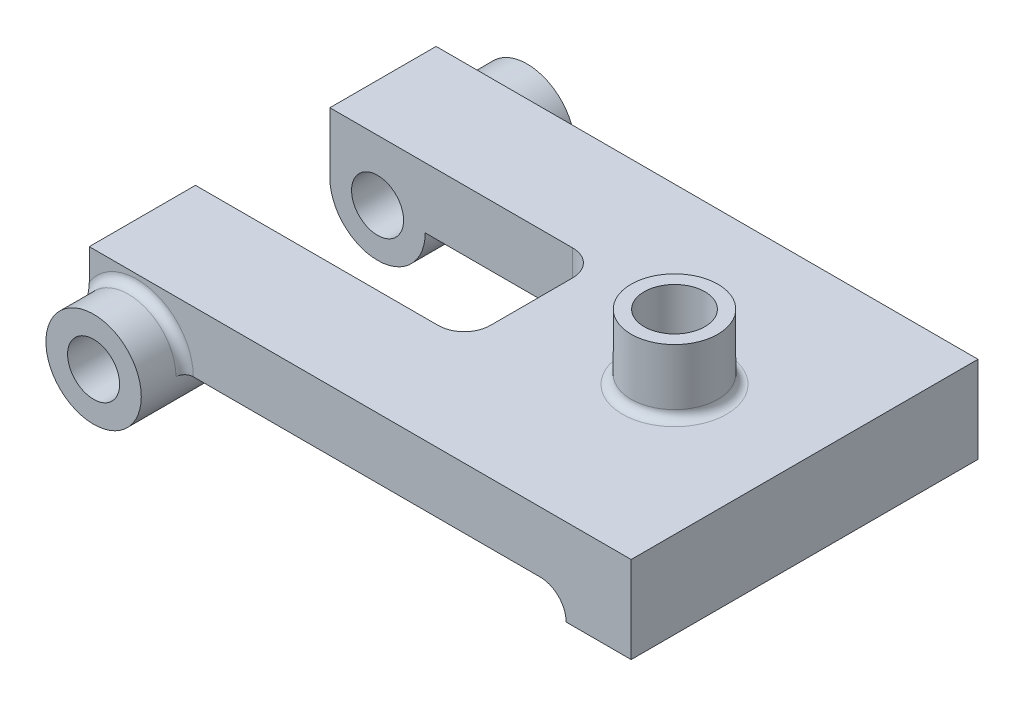
ISO-10303-21;
HEADER;
FILE_DESCRIPTION(('STEP AP214'),'2;1');
FILE_NAME('part.step','',(''),(''),'','','');
FILE_SCHEMA(('AUTOMOTIVE_DESIGN { 1 0 10303 214 1 1 1 1 }'));
ENDSEC;
DATA;
#1=APPLICATION_CONTEXT('core data for automotive mechanical design processes');
#2=APPLICATION_PROTOCOL_DEFINITION('international standard','automotive_design',2000,#1);
#3=PRODUCT_CONTEXT('',#1,'mechanical');
#4=PRODUCT('Part','Part','',(#3));
#5=PRODUCT_RELATED_PRODUCT_CATEGORY('part','',(#4));
#6=PRODUCT_DEFINITION_FORMATION('','',#4);
#7=PRODUCT_DEFINITION_CONTEXT('part definition',#1,'design');
#8=PRODUCT_DEFINITION('design','',#6,#7);
#9=PRODUCT_DEFINITION_SHAPE('','',#8);
#10=(LENGTH_UNIT() NAMED_UNIT(*) SI_UNIT(.MILLI.,.METRE.));
#11=(NAMED_UNIT(*) PLANE_ANGLE_UNIT() SI_UNIT($,.RADIAN.));
#12=(NAMED_UNIT(*) SI_UNIT($,.STERADIAN.) SOLID_ANGLE_UNIT());
#13=UNCERTAINTY_MEASURE_WITH_UNIT(LENGTH_MEASURE(1.E-05),#10,'distance_accuracy_value','');
#14=(GEOMETRIC_REPRESENTATION_CONTEXT(3) GLOBAL_UNCERTAINTY_ASSIGNED_CONTEXT((#13)) GLOBAL_UNIT_ASSIGNED_CONTEXT((#10,
#11,#12)) REPRESENTATION_CONTEXT('',''));
#15=CARTESIAN_POINT('',(0.,0.,0.));
#16=DIRECTION('',(0.,0.,1.));
#17=DIRECTION('',(1.,0.,0.));
#18=AXIS2_PLACEMENT_3D('',#15,#16,#17);
#19=CARTESIAN_POINT('',(0.,6.,-50.));
#20=DIRECTION('',(0.,-1.,0.));
#21=DIRECTION('',(1.,0.,0.));
#22=AXIS2_PLACEMENT_3D('',#19,#20,#21);
#23=PLANE('',#22);
#24=CARTESIAN_POINT('',(32.5,6.,0.00259627898913095));
#25=DIRECTION('',(0.,-1.,0.));
#26=DIRECTION('',(1.,0.,0.));
#27=AXIS2_PLACEMENT_3D('',#24,#25,#26);
#28=CIRCLE('',#27,7.99999999999998);
#29=CARTESIAN_POINT('',(40.5,6.,0.00259627898913095));
#30=VERTEX_POINT('',#29);
#31=EDGE_CURVE('E90',#30,#30,#28,.T.);
#32=ORIENTED_EDGE('',*,*,#31,.F.);
#33=EDGE_LOOP('',(#32));
#34=FACE_BOUND('',#33,.T.);
#35=DIRECTION('',(-1.,0.,0.));
#36=VECTOR('',#35,1.);
#37=CARTESIAN_POINT('',(0.,6.,-40.));
#38=LINE('',#37,#36);
#39=CARTESIAN_POINT('',(41.5,6.,-40.));
#40=VERTEX_POINT('',#39);
#41=CARTESIAN_POINT('',(-38.5,6.,-40.));
#42=VERTEX_POINT('',#41);
#43=EDGE_CURVE('E209',#40,#42,#38,.T.);
#44=ORIENTED_EDGE('',*,*,#43,.F.);
#45=DIRECTION('',(0.,0.,1.));
#46=VECTOR('',#45,1.);
#47=CARTESIAN_POINT('',(41.5,6.,40.));
#48=LINE('',#47,#46);
#49=CARTESIAN_POINT('',(41.5,6.,40.));
#50=VERTEX_POINT('',#49);
#51=EDGE_CURVE('E388',#40,#50,#48,.T.);
#52=ORIENTED_EDGE('',*,*,#51,.T.);
#53=DIRECTION('',(-1.,0.,0.));
#54=VECTOR('',#53,1.);
#55=CARTESIAN_POINT('',(0.,6.,40.));
#56=LINE('',#55,#54);
#57=CARTESIAN_POINT('',(-38.5,6.,40.));
#58=VERTEX_POINT('',#57);
#59=EDGE_CURVE('E258',#50,#58,#56,.T.);
#60=ORIENTED_EDGE('',*,*,#59,.T.);
#61=CARTESIAN_POINT('',(-38.5,6.,42.));
#62=DIRECTION('',(0.,-1.,0.));
#63=DIRECTION('',(1.,0.,0.));
#64=AXIS2_PLACEMENT_3D('',#61,#62,#63);
#65=CIRCLE('',#64,2.);
#66=CARTESIAN_POINT('',(-40.5,6.,42.));
#67=VERTEX_POINT('',#66);
#68=EDGE_CURVE('E301',#58,#67,#65,.F.);
#69=ORIENTED_EDGE('',*,*,#68,.T.);
#70=DIRECTION('',(0.,0.,1.));
#71=VECTOR('',#70,1.);
#72=CARTESIAN_POINT('',(-40.5,6.,-50.));
#73=LINE('',#72,#71);
#74=CARTESIAN_POINT('',(-40.5,6.,15.5));
#75=VERTEX_POINT('',#74);
#76=EDGE_CURVE('E238',#75,#67,#73,.T.);
#77=ORIENTED_EDGE('',*,*,#76,.F.);
#78=DIRECTION('',(1.,0.,0.));
#79=VECTOR('',#78,1.);
#80=CARTESIAN_POINT('',(0.,6.,15.5));
#81=LINE('',#80,#79);
#82=CARTESIAN_POINT('',(-6.50000000000001,6.,15.5));
#83=VERTEX_POINT('',#82);
#84=EDGE_CURVE('E274',#75,#83,#81,.T.);
#85=ORIENTED_EDGE('',*,*,#84,.T.);
#86=CARTESIAN_POINT('',(-6.50000000000001,6.,9.5));
#87=DIRECTION('',(0.,-1.,0.));
#88=DIRECTION('',(1.,0.,0.));
#89=AXIS2_PLACEMENT_3D('',#86,#87,#88);
#90=CIRCLE('',#89,6.);
#91=CARTESIAN_POINT('',(-0.500000000000014,6.,9.5));
#92=VERTEX_POINT('',#91);
#93=EDGE_CURVE('E404',#83,#92,#90,.F.);
#94=ORIENTED_EDGE('',*,*,#93,.T.);
#95=DIRECTION('',(0.,0.,-1.));
#96=VECTOR('',#95,1.);
#97=CARTESIAN_POINT('',(-0.500000000000014,6.,-50.));
#98=LINE('',#97,#96);
#99=CARTESIAN_POINT('',(-0.500000000000014,6.,-9.5));
#100=VERTEX_POINT('',#99);
#101=EDGE_CURVE('E424',#92,#100,#98,.T.);
#102=ORIENTED_EDGE('',*,*,#101,.T.);
#103=CARTESIAN_POINT('',(-6.50000000000001,6.,-9.5));
#104=DIRECTION('',(0.,-1.,0.));
#105=DIRECTION('',(1.,0.,0.));
#106=AXIS2_PLACEMENT_3D('',#103,#104,#105);
#107=CIRCLE('',#106,6.);
#108=CARTESIAN_POINT('',(-6.50000000000001,6.,-15.5));
#109=VERTEX_POINT('',#108);
#110=EDGE_CURVE('E396',#100,#109,#107,.F.);
#111=ORIENTED_EDGE('',*,*,#110,.T.);
#112=DIRECTION('',(-1.,0.,0.));
#113=VECTOR('',#112,1.);
#114=CARTESIAN_POINT('',(0.,6.,-15.5));
#115=LINE('',#114,#113);
#116=CARTESIAN_POINT('',(-40.5,6.,-15.5));
#117=VERTEX_POINT('',#116);
#118=EDGE_CURVE('E429',#109,#117,#115,.T.);
#119=ORIENTED_EDGE('',*,*,#118,.T.);
#120=CARTESIAN_POINT('',(-40.5,6.,-42.));
#121=VERTEX_POINT('',#120);
#122=EDGE_CURVE('E235',#121,#117,#73,.T.);
#123=ORIENTED_EDGE('',*,*,#122,.F.);
#124=CARTESIAN_POINT('',(-38.5,6.,-42.));
#125=DIRECTION('',(0.,-1.,0.));
#126=DIRECTION('',(1.,0.,0.));
#127=AXIS2_PLACEMENT_3D('',#124,#125,#126);
#128=CIRCLE('',#127,2.);
#129=EDGE_CURVE('E290',#121,#42,#128,.F.);
#130=ORIENTED_EDGE('',*,*,#129,.T.);
#131=EDGE_LOOP('',(#44,#52,#60,#69,#77,#85,#94,#102,#111,#119,#123,#130));
#132=FACE_BOUND('',#131,.T.);
#133=ADVANCED_FACE('F86',(#34,#132),#23,.T.);
#134=CARTESIAN_POINT('',(0.,20.,-50.));
#135=DIRECTION('',(0.,-1.,0.));
#136=DIRECTION('',(1.,0.,0.));
#137=AXIS2_PLACEMENT_3D('',#134,#135,#136);
#138=PLANE('',#137);
#139=CARTESIAN_POINT('',(32.5,20.,0.00259627898913095));
#140=DIRECTION('',(0.,-1.,0.));
#141=DIRECTION('',(1.,0.,0.));
#142=AXIS2_PLACEMENT_3D('',#139,#140,#141);
#143=CIRCLE('',#142,12.);
#144=CARTESIAN_POINT('',(44.5,20.,0.00259627898913095));
#145=VERTEX_POINT('',#144);
#146=EDGE_CURVE('E277',#145,#145,#143,.T.);
#147=ORIENTED_EDGE('',*,*,#146,.T.);
#148=EDGE_LOOP('',(#147));
#149=FACE_BOUND('',#148,.T.);
#150=DIRECTION('',(-1.,0.,0.));
#151=VECTOR('',#150,1.);
#152=CARTESIAN_POINT('',(0.,20.,-40.));
#153=LINE('',#152,#151);
#154=CARTESIAN_POINT('',(62.5,20.,-40.));
#155=VERTEX_POINT('',#154);
#156=CARTESIAN_POINT('',(-62.5,20.,-39.9999999999999));
#157=VERTEX_POINT('',#156);
#158=EDGE_CURVE('E199',#155,#157,#153,.T.);
#159=ORIENTED_EDGE('',*,*,#158,.T.);
#160=DIRECTION('',(0.,0.,1.));
#161=VECTOR('',#160,1.);
#162=CARTESIAN_POINT('',(-62.5,20.,-50.));
#163=LINE('',#162,#161);
#164=CARTESIAN_POINT('',(-62.5,20.,-15.5));
#165=VERTEX_POINT('',#164);
#166=EDGE_CURVE('E204',#157,#165,#163,.T.);
#167=ORIENTED_EDGE('',*,*,#166,.T.);
#168=DIRECTION('',(-1.,0.,0.));
#169=VECTOR('',#168,1.);
#170=CARTESIAN_POINT('',(-0.500000000000014,20.,-15.5));
#171=LINE('',#170,#169);
#172=CARTESIAN_POINT('',(-6.50000000000001,20.,-15.5));
#173=VERTEX_POINT('',#172);
#174=EDGE_CURVE('E419',#173,#165,#171,.T.);
#175=ORIENTED_EDGE('',*,*,#174,.F.);
#176=CARTESIAN_POINT('',(-6.50000000000001,20.,-9.5));
#177=DIRECTION('',(0.,-1.,0.));
#178=DIRECTION('',(1.,0.,0.));
#179=AXIS2_PLACEMENT_3D('',#176,#177,#178);
#180=CIRCLE('',#179,6.);
#181=CARTESIAN_POINT('',(-0.500000000000014,20.,-9.5));
#182=VERTEX_POINT('',#181);
#183=EDGE_CURVE('E393',#173,#182,#180,.T.);
#184=ORIENTED_EDGE('',*,*,#183,.T.);
#185=DIRECTION('',(0.,0.,1.));
#186=VECTOR('',#185,1.);
#187=CARTESIAN_POINT('',(-0.500000000000014,20.,-15.5));
#188=LINE('',#187,#186);
#189=CARTESIAN_POINT('',(-0.500000000000014,20.,9.5));
#190=VERTEX_POINT('',#189);
#191=EDGE_CURVE('E411',#182,#190,#188,.T.);
#192=ORIENTED_EDGE('',*,*,#191,.T.);
#193=CARTESIAN_POINT('',(-6.50000000000001,20.,9.5));
#194=DIRECTION('',(0.,-1.,0.));
#195=DIRECTION('',(1.,0.,0.));
#196=AXIS2_PLACEMENT_3D('',#193,#194,#195);
#197=CIRCLE('',#196,6.);
#198=CARTESIAN_POINT('',(-6.50000000000001,20.,15.5));
#199=VERTEX_POINT('',#198);
#200=EDGE_CURVE('E391',#190,#199,#197,.T.);
#201=ORIENTED_EDGE('',*,*,#200,.T.);
#202=DIRECTION('',(-1.,0.,0.));
#203=VECTOR('',#202,1.);
#204=CARTESIAN_POINT('',(-0.500000000000014,20.,15.5));
#205=LINE('',#204,#203);
#206=CARTESIAN_POINT('',(-62.5,20.,15.5));
#207=VERTEX_POINT('',#206);
#208=EDGE_CURVE('E408',#199,#207,#205,.T.);
#209=ORIENTED_EDGE('',*,*,#208,.T.);
#210=CARTESIAN_POINT('',(-62.5,20.,39.9999999999999));
#211=VERTEX_POINT('',#210);
#212=EDGE_CURVE('E226',#207,#211,#163,.T.);
#213=ORIENTED_EDGE('',*,*,#212,.T.);
#214=DIRECTION('',(-1.,0.,0.));
#215=VECTOR('',#214,1.);
#216=CARTESIAN_POINT('',(0.,20.,40.));
#217=LINE('',#216,#215);
#218=CARTESIAN_POINT('',(62.5,20.,40.));
#219=VERTEX_POINT('',#218);
#220=EDGE_CURVE('E210',#219,#211,#217,.T.);
#221=ORIENTED_EDGE('',*,*,#220,.F.);
#222=DIRECTION('',(0.,0.,1.));
#223=VECTOR('',#222,1.);
#224=CARTESIAN_POINT('',(62.5,20.,-50.));
#225=LINE('',#224,#223);
#226=EDGE_CURVE('E207',#155,#219,#225,.T.);
#227=ORIENTED_EDGE('',*,*,#226,.F.);
#228=EDGE_LOOP('',(#159,#167,#175,#184,#192,#201,#209,#213,#221,#227));
#229=FACE_BOUND('',#228,.T.);
#230=ADVANCED_FACE('F201',(#149,#229),#138,.F.);
#231=CARTESIAN_POINT('',(-62.5,40.,0.));
#232=DIRECTION('',(-1.,0.,0.));
#233=DIRECTION('',(0.,0.,1.));
#234=AXIS2_PLACEMENT_3D('',#231,#232,#233);
#235=PLANE('',#234);
#236=ORIENTED_EDGE('',*,*,#166,.F.);
#237=DIRECTION('',(0.,-1.,0.));
#238=VECTOR('',#237,1.);
#239=CARTESIAN_POINT('',(-62.5,20.,-39.9999999999999));
#240=LINE('',#239,#238);
#241=CARTESIAN_POINT('',(-62.5,12.9282032302755,-39.9999999999999));
#242=VERTEX_POINT('',#241);
#243=EDGE_CURVE('E213',#157,#242,#240,.T.);
#244=ORIENTED_EDGE('',*,*,#243,.T.);
#245=CARTESIAN_POINT('',(-62.5,12.9282032302755,-40.));
#246=CARTESIAN_POINT('',(-62.5,12.7963187833858,-40.0000195877206));
#247=CARTESIAN_POINT('',(-62.5,12.6644773142554,-40.0037039568171));
#248=CARTESIAN_POINT('',(-62.5,12.401213359847,-40.0176384033788));
#249=CARTESIAN_POINT('',(-62.5,12.2697906737522,-40.0278846179911));
#250=CARTESIAN_POINT('',(-62.5,12.0079076300548,-40.0541440086295));
#251=CARTESIAN_POINT('',(-62.5,11.8774456101903,-40.0701410055851));
#252=CARTESIAN_POINT('',(-62.5,11.6172435265703,-40.1072767015446));
#253=CARTESIAN_POINT('',(-62.5,11.487503583761,-40.1284162368851));
#254=CARTESIAN_POINT('',(-62.5,11.1022236983332,-40.1981930126891));
#255=CARTESIAN_POINT('',(-62.5,10.8478799064358,-40.2534888297196));
#256=CARTESIAN_POINT('',(-62.5,10.3425690922877,-40.378254542835));
#257=CARTESIAN_POINT('',(-62.5,10.0916050106021,-40.4477360266854));
#258=CARTESIAN_POINT('',(-62.5,9.51579220612521,-40.621030161393));
#259=CARTESIAN_POINT('',(-62.5,9.19214679587692,-40.7288093836489));
#260=CARTESIAN_POINT('',(-62.5,8.54957173398144,-40.9576910405936));
#261=CARTESIAN_POINT('',(-62.5,8.23064375632916,-41.0787980818576));
#262=CARTESIAN_POINT('',(-62.5,7.27744390124665,-41.4553689198497));
#263=CARTESIAN_POINT('',(-62.5,6.64828802641789,-41.7235697880345));
#264=CARTESIAN_POINT('',(-62.5,6.01286350787568,-41.9945149951125));
#265=CARTESIAN_POINT('',(-62.5,6.00643174896292,-41.9972575065244));
#266=CARTESIAN_POINT('',(-62.5,6.,-42.));
#267=B_SPLINE_CURVE_WITH_KNOTS('',3,(#245,#246,#247,#248,#249,#250,#251,#252,#253,#254,#255,
#256,#257,#258,#259,#260,#261,#262,#263,#264,#265,#266),.UNSPECIFIED.,.F.,.F.,(4,2,2,2,2,2,2,2,
2,2,4),(0.,0.395540642761234,0.790848650885472,1.18505310550786,1.57932171293083,
2.3595985643319,3.14051536472966,4.16341984179214,5.18667898860666,7.23803512077275,
7.25901129773618),.UNSPECIFIED.);
#268=CARTESIAN_POINT('',(-62.5,6.,-42.));
#269=VERTEX_POINT('',#268);
#270=EDGE_CURVE('E293',#242,#269,#267,.T.);
#271=ORIENTED_EDGE('',*,*,#270,.T.);
#272=DIRECTION('',(0.,0.,1.));
#273=VECTOR('',#272,1.);
#274=CARTESIAN_POINT('',(-62.5,6.,-50.));
#275=LINE('',#274,#273);
#276=CARTESIAN_POINT('',(-62.5,6.,-15.5));
#277=VERTEX_POINT('',#276);
#278=EDGE_CURVE('E239',#269,#277,#275,.T.);
#279=ORIENTED_EDGE('',*,*,#278,.T.);
#280=DIRECTION('',(0.,1.,0.));
#281=VECTOR('',#280,1.);
#282=CARTESIAN_POINT('',(-62.5,0.,-15.5));
#283=LINE('',#282,#281);
#284=EDGE_CURVE('E225',#277,#165,#283,.T.);
#285=ORIENTED_EDGE('',*,*,#284,.T.);
#286=EDGE_LOOP('',(#236,#244,#271,#279,#285));
#287=FACE_BOUND('',#286,.T.);
#288=ADVANCED_FACE('F223',(#287),#235,.T.);
#289=CARTESIAN_POINT('',(0.,40.,-50.0000000000001));
#290=DIRECTION('',(0.,0.,-1.));
#291=DIRECTION('',(-1.,0.,0.));
#292=AXIS2_PLACEMENT_3D('',#289,#290,#291);
#293=PLANE('',#292);
#294=CARTESIAN_POINT('',(-51.5,6.,-50.));
#295=DIRECTION('',(0.,0.,1.));
#296=DIRECTION('',(1.,0.,0.));
#297=AXIS2_PLACEMENT_3D('',#294,#295,#296);
#298=CIRCLE('',#297,5.99999999999999);
#299=CARTESIAN_POINT('',(-45.5,6.,-50.));
#300=VERTEX_POINT('',#299);
#301=EDGE_CURVE('E265',#300,#300,#298,.T.);
#302=ORIENTED_EDGE('',*,*,#301,.T.);
#303=EDGE_LOOP('',(#302));
#304=FACE_BOUND('',#303,.T.);
#305=CARTESIAN_POINT('',(-51.5,6.,-50.));
#306=DIRECTION('',(0.,0.,1.));
#307=DIRECTION('',(1.,0.,0.));
#308=AXIS2_PLACEMENT_3D('',#305,#306,#307);
#309=CIRCLE('',#308,11.);
#310=CARTESIAN_POINT('',(-40.5,6.,-50.));
#311=VERTEX_POINT('',#310);
#312=EDGE_CURVE('E232',#311,#311,#309,.T.);
#313=ORIENTED_EDGE('',*,*,#312,.F.);
#314=EDGE_LOOP('',(#313));
#315=FACE_BOUND('',#314,.T.);
#316=ADVANCED_FACE('F311',(#304,#315),#293,.T.);
#317=CARTESIAN_POINT('',(-62.5,6.,15.5));
#318=VERTEX_POINT('',#317);
#319=CARTESIAN_POINT('',(-62.5,6.,42.));
#320=VERTEX_POINT('',#319);
#321=EDGE_CURVE('E240',#318,#320,#275,.T.);
#322=ORIENTED_EDGE('',*,*,#321,.T.);
#323=CARTESIAN_POINT('',(-62.5,12.9282032302755,40.));
#324=CARTESIAN_POINT('',(-62.5,12.7963187833858,40.0000195877206));
#325=CARTESIAN_POINT('',(-62.5,12.6644773142554,40.0037039568171));
#326=CARTESIAN_POINT('',(-62.5,12.401213359847,40.0176384033788));
#327=CARTESIAN_POINT('',(-62.5,12.2697906737522,40.0278846179911));
#328=CARTESIAN_POINT('',(-62.5,12.0079076300548,40.0541440086295));
#329=CARTESIAN_POINT('',(-62.5,11.8774456101903,40.0701410055851));
#330=CARTESIAN_POINT('',(-62.5,11.6172435265703,40.1072767015446));
#331=CARTESIAN_POINT('',(-62.5,11.487503583761,40.1284162368851));
#332=CARTESIAN_POINT('',(-62.5,11.1022236983332,40.1981930126891));
#333=CARTESIAN_POINT('',(-62.5,10.8478799064358,40.2534888297196));
#334=CARTESIAN_POINT('',(-62.5,10.3425690922877,40.378254542835));
#335=CARTESIAN_POINT('',(-62.5,10.0916050106021,40.4477360266854));
#336=CARTESIAN_POINT('',(-62.5,9.51579220612521,40.621030161393));
#337=CARTESIAN_POINT('',(-62.5,9.19214679587692,40.7288093836489));
#338=CARTESIAN_POINT('',(-62.5,8.54957173398143,40.9576910405936));
#339=CARTESIAN_POINT('',(-62.5,8.23064375632916,41.0787980818576));
#340=CARTESIAN_POINT('',(-62.5,7.27744390124665,41.4553689198497));
#341=CARTESIAN_POINT('',(-62.5,6.64828802641788,41.7235697880345));
#342=CARTESIAN_POINT('',(-62.5,6.01286350787568,41.9945149951125));
#343=CARTESIAN_POINT('',(-62.5,6.00643174896292,41.9972575065244));
#344=CARTESIAN_POINT('',(-62.5,6.,42.));
#345=B_SPLINE_CURVE_WITH_KNOTS('',3,(#323,#324,#325,#326,#327,#328,#329,#330,#331,#332,#333,
#334,#335,#336,#337,#338,#339,#340,#341,#342,#343,#344),.UNSPECIFIED.,.F.,.F.,(4,2,2,2,2,2,2,2,
2,2,4),(0.,0.395540642761231,0.790848650885467,1.18505310550785,1.57932171293082,
2.3595985643319,3.14051536472966,4.16341984179215,5.18667898860667,7.23803512077275,
7.25901129773618),.UNSPECIFIED.);
#346=CARTESIAN_POINT('',(-62.5,12.9282032302755,39.9999999999999));
#347=VERTEX_POINT('',#346);
#348=EDGE_CURVE('E317',#320,#347,#345,.F.);
#349=ORIENTED_EDGE('',*,*,#348,.T.);
#350=DIRECTION('',(0.,-1.,0.));
#351=VECTOR('',#350,1.);
#352=CARTESIAN_POINT('',(-62.5,20.,39.9999999999999));
#353=LINE('',#352,#351);
#354=EDGE_CURVE('E220',#211,#347,#353,.T.);
#355=ORIENTED_EDGE('',*,*,#354,.F.);
#356=ORIENTED_EDGE('',*,*,#212,.F.);
#357=DIRECTION('',(0.,-1.,0.));
#358=VECTOR('',#357,1.);
#359=CARTESIAN_POINT('',(-62.5,0.,15.5));
#360=LINE('',#359,#358);
#361=EDGE_CURVE('E418',#207,#318,#360,.T.);
#362=ORIENTED_EDGE('',*,*,#361,.T.);
#363=EDGE_LOOP('',(#322,#349,#355,#356,#362));
#364=FACE_BOUND('',#363,.T.);
#365=ADVANCED_FACE('F312',(#364),#235,.T.);
#366=CARTESIAN_POINT('',(-51.5,6.,-50.));
#367=DIRECTION('',(0.,0.,1.));
#368=DIRECTION('',(1.,0.,0.));
#369=AXIS2_PLACEMENT_3D('',#366,#367,#368);
#370=CYLINDRICAL_SURFACE('',#369,11.);
#371=CARTESIAN_POINT('',(-51.5,6.,-42.));
#372=DIRECTION('',(0.,0.,-1.));
#373=DIRECTION('',(-1.,0.,0.));
#374=AXIS2_PLACEMENT_3D('',#371,#372,#373);
#375=CIRCLE('',#374,11.);
#376=EDGE_CURVE('E280',#269,#121,#375,.T.);
#377=ORIENTED_EDGE('',*,*,#376,.T.);
#378=ORIENTED_EDGE('',*,*,#122,.T.);
#379=CARTESIAN_POINT('',(-51.5,6.,-15.5));
#380=DIRECTION('',(0.,0.,1.));
#381=DIRECTION('',(1.,0.,0.));
#382=AXIS2_PLACEMENT_3D('',#379,#380,#381);
#383=CIRCLE('',#382,11.);
#384=EDGE_CURVE('E273',#117,#277,#383,.F.);
#385=ORIENTED_EDGE('',*,*,#384,.T.);
#386=ORIENTED_EDGE('',*,*,#278,.F.);
#387=EDGE_LOOP('',(#377,#378,#385,#386));
#388=FACE_BOUND('',#387,.T.);
#389=ORIENTED_EDGE('',*,*,#312,.T.);
#390=EDGE_LOOP('',(#389));
#391=FACE_BOUND('',#390,.T.);
#392=ADVANCED_FACE('F353',(#388,#391),#370,.T.);
#393=CARTESIAN_POINT('',(-51.5,6.,50.));
#394=DIRECTION('',(0.,0.,1.));
#395=DIRECTION('',(1.,0.,0.));
#396=AXIS2_PLACEMENT_3D('',#393,#394,#395);
#397=CIRCLE('',#396,11.);
#398=CARTESIAN_POINT('',(-40.5,6.,50.));
#399=VERTEX_POINT('',#398);
#400=EDGE_CURVE('E264',#399,#399,#397,.T.);
#401=ORIENTED_EDGE('',*,*,#400,.F.);
#402=EDGE_LOOP('',(#401));
#403=FACE_BOUND('',#402,.T.);
#404=ORIENTED_EDGE('',*,*,#76,.T.);
#405=CARTESIAN_POINT('',(-51.5,6.,42.));
#406=DIRECTION('',(0.,0.,-1.));
#407=DIRECTION('',(-1.,0.,0.));
#408=AXIS2_PLACEMENT_3D('',#405,#406,#407);
#409=CIRCLE('',#408,11.);
#410=EDGE_CURVE('E287',#67,#320,#409,.F.);
#411=ORIENTED_EDGE('',*,*,#410,.T.);
#412=ORIENTED_EDGE('',*,*,#321,.F.);
#413=CARTESIAN_POINT('',(-51.5,6.,15.5));
#414=DIRECTION('',(0.,0.,-1.));
#415=DIRECTION('',(0.,1.,0.));
#416=AXIS2_PLACEMENT_3D('',#413,#414,#415);
#417=CIRCLE('',#416,11.);
#418=EDGE_CURVE('E269',#318,#75,#417,.F.);
#419=ORIENTED_EDGE('',*,*,#418,.T.);
#420=EDGE_LOOP('',(#404,#411,#412,#419));
#421=FACE_BOUND('',#420,.T.);
#422=ADVANCED_FACE('F356',(#403,#421),#370,.T.);
#423=CARTESIAN_POINT('',(-51.5,6.,-50.));
#424=DIRECTION('',(0.,0.,1.));
#425=DIRECTION('',(1.,0.,0.));
#426=AXIS2_PLACEMENT_3D('',#423,#424,#425);
#427=CYLINDRICAL_SURFACE('',#426,5.99999999999999);
#428=ORIENTED_EDGE('',*,*,#301,.F.);
#429=EDGE_LOOP('',(#428));
#430=FACE_BOUND('',#429,.T.);
#431=CARTESIAN_POINT('',(-51.5,6.,-15.5));
#432=DIRECTION('',(0.,0.,1.));
#433=DIRECTION('',(1.,0.,0.));
#434=AXIS2_PLACEMENT_3D('',#431,#432,#433);
#435=CIRCLE('',#434,5.99999999999999);
#436=CARTESIAN_POINT('',(-45.5,6.,-15.5));
#437=VERTEX_POINT('',#436);
#438=EDGE_CURVE('E270',#437,#437,#435,.F.);
#439=ORIENTED_EDGE('',*,*,#438,.F.);
#440=EDGE_LOOP('',(#439));
#441=FACE_BOUND('',#440,.T.);
#442=ADVANCED_FACE('F501',(#430,#441),#427,.F.);
#443=CARTESIAN_POINT('',(-51.5,6.,50.));
#444=DIRECTION('',(0.,0.,-1.));
#445=DIRECTION('',(-1.,0.,0.));
#446=AXIS2_PLACEMENT_3D('',#443,#444,#445);
#447=CIRCLE('',#446,5.99999999999999);
#448=CARTESIAN_POINT('',(-57.5,6.,50.));
#449=VERTEX_POINT('',#448);
#450=EDGE_CURVE('E261',#449,#449,#447,.T.);
#451=ORIENTED_EDGE('',*,*,#450,.F.);
#452=EDGE_LOOP('',(#451));
#453=FACE_BOUND('',#452,.T.);
#454=CARTESIAN_POINT('',(-51.5,6.,15.5));
#455=DIRECTION('',(0.,0.,-1.));
#456=DIRECTION('',(0.,1.,0.));
#457=AXIS2_PLACEMENT_3D('',#454,#455,#456);
#458=CIRCLE('',#457,5.99999999999999);
#459=CARTESIAN_POINT('',(-51.5,12.,15.5));
#460=VERTEX_POINT('',#459);
#461=EDGE_CURVE('E266',#460,#460,#458,.F.);
#462=ORIENTED_EDGE('',*,*,#461,.F.);
#463=EDGE_LOOP('',(#462));
#464=FACE_BOUND('',#463,.T.);
#465=ADVANCED_FACE('F503',(#453,#464),#427,.F.);
#466=CARTESIAN_POINT('',(0.,40.,-40.));
#467=DIRECTION('',(0.,0.,-1.));
#468=DIRECTION('',(-1.,0.,0.));
#469=AXIS2_PLACEMENT_3D('',#466,#467,#468);
#470=PLANE('',#469);
#471=DIRECTION('',(1.,0.,0.));
#472=VECTOR('',#471,1.);
#473=CARTESIAN_POINT('',(0.,0.,-40.));
#474=LINE('',#473,#472);
#475=CARTESIAN_POINT('',(47.5,0.,-40.));
#476=VERTEX_POINT('',#475);
#477=CARTESIAN_POINT('',(62.5,0.,-40.));
#478=VERTEX_POINT('',#477);
#479=EDGE_CURVE('E243',#476,#478,#474,.T.);
#480=ORIENTED_EDGE('',*,*,#479,.F.);
#481=CARTESIAN_POINT('',(41.5,0.,-40.));
#482=DIRECTION('',(0.,0.,-1.));
#483=DIRECTION('',(-1.,0.,0.));
#484=AXIS2_PLACEMENT_3D('',#481,#482,#483);
#485=CIRCLE('',#484,6.);
#486=EDGE_CURVE('E12',#476,#40,#485,.F.);
#487=ORIENTED_EDGE('',*,*,#486,.T.);
#488=ORIENTED_EDGE('',*,*,#43,.T.);
#489=CARTESIAN_POINT('',(-51.5,6.,-40.));
#490=DIRECTION('',(0.,0.,-1.));
#491=DIRECTION('',(-1.,0.,0.));
#492=AXIS2_PLACEMENT_3D('',#489,#490,#491);
#493=CIRCLE('',#492,13.);
#494=EDGE_CURVE('E216',#42,#242,#493,.F.);
#495=ORIENTED_EDGE('',*,*,#494,.T.);
#496=ORIENTED_EDGE('',*,*,#243,.F.);
#497=ORIENTED_EDGE('',*,*,#158,.F.);
#498=DIRECTION('',(0.,-1.,0.));
#499=VECTOR('',#498,1.);
#500=CARTESIAN_POINT('',(62.5,40.,-40.));
#501=LINE('',#500,#499);
#502=EDGE_CURVE('E252',#155,#478,#501,.T.);
#503=ORIENTED_EDGE('',*,*,#502,.T.);
#504=EDGE_LOOP('',(#480,#487,#488,#495,#496,#497,#503));
#505=FACE_BOUND('',#504,.T.);
#506=ADVANCED_FACE('F214',(#505),#470,.T.);
#507=CARTESIAN_POINT('',(0.,40.,49.9999999999999));
#508=DIRECTION('',(0.,0.,-1.));
#509=DIRECTION('',(-1.,0.,0.));
#510=AXIS2_PLACEMENT_3D('',#507,#508,#509);
#511=PLANE('',#510);
#512=ORIENTED_EDGE('',*,*,#450,.T.);
#513=EDGE_LOOP('',(#512));
#514=FACE_BOUND('',#513,.T.);
#515=ORIENTED_EDGE('',*,*,#400,.T.);
#516=EDGE_LOOP('',(#515));
#517=FACE_BOUND('',#516,.T.);
#518=ADVANCED_FACE('F313',(#514,#517),#511,.F.);
#519=CARTESIAN_POINT('',(0.,40.,40.));
#520=DIRECTION('',(0.,0.,-1.));
#521=DIRECTION('',(-1.,0.,0.));
#522=AXIS2_PLACEMENT_3D('',#519,#520,#521);
#523=PLANE('',#522);
#524=ORIENTED_EDGE('',*,*,#354,.T.);
#525=CARTESIAN_POINT('',(-51.5,6.,40.));
#526=DIRECTION('',(0.,0.,-1.));
#527=DIRECTION('',(-1.,0.,0.));
#528=AXIS2_PLACEMENT_3D('',#525,#526,#527);
#529=CIRCLE('',#528,13.);
#530=EDGE_CURVE('E284',#347,#58,#529,.T.);
#531=ORIENTED_EDGE('',*,*,#530,.T.);
#532=ORIENTED_EDGE('',*,*,#59,.F.);
#533=CARTESIAN_POINT('',(41.5,0.,40.));
#534=DIRECTION('',(0.,0.,-1.));
#535=DIRECTION('',(-1.,0.,0.));
#536=AXIS2_PLACEMENT_3D('',#533,#534,#535);
#537=CIRCLE('',#536,6.);
#538=CARTESIAN_POINT('',(47.5,0.,40.));
#539=VERTEX_POINT('',#538);
#540=EDGE_CURVE('E95',#50,#539,#537,.T.);
#541=ORIENTED_EDGE('',*,*,#540,.T.);
#542=DIRECTION('',(1.,0.,0.));
#543=VECTOR('',#542,1.);
#544=CARTESIAN_POINT('',(0.,0.,40.));
#545=LINE('',#544,#543);
#546=CARTESIAN_POINT('',(62.5,0.,40.));
#547=VERTEX_POINT('',#546);
#548=EDGE_CURVE('E246',#539,#547,#545,.T.);
#549=ORIENTED_EDGE('',*,*,#548,.T.);
#550=DIRECTION('',(0.,-1.,0.));
#551=VECTOR('',#550,1.);
#552=CARTESIAN_POINT('',(62.5,40.,40.));
#553=LINE('',#552,#551);
#554=EDGE_CURVE('E254',#219,#547,#553,.T.);
#555=ORIENTED_EDGE('',*,*,#554,.F.);
#556=ORIENTED_EDGE('',*,*,#220,.T.);
#557=EDGE_LOOP('',(#524,#531,#532,#541,#549,#555,#556));
#558=FACE_BOUND('',#557,.T.);
#559=ADVANCED_FACE('F365',(#558),#523,.F.);
#560=CARTESIAN_POINT('',(62.5,40.,0.));
#561=DIRECTION('',(-1.,0.,0.));
#562=DIRECTION('',(0.,0.,1.));
#563=AXIS2_PLACEMENT_3D('',#560,#561,#562);
#564=PLANE('',#563);
#565=ORIENTED_EDGE('',*,*,#502,.F.);
#566=ORIENTED_EDGE('',*,*,#226,.T.);
#567=ORIENTED_EDGE('',*,*,#554,.T.);
#568=DIRECTION('',(0.,0.,-1.));
#569=VECTOR('',#568,1.);
#570=CARTESIAN_POINT('',(62.5,0.,0.));
#571=LINE('',#570,#569);
#572=EDGE_CURVE('E249',#547,#478,#571,.T.);
#573=ORIENTED_EDGE('',*,*,#572,.T.);
#574=EDGE_LOOP('',(#565,#566,#567,#573));
#575=FACE_BOUND('',#574,.T.);
#576=ADVANCED_FACE('F362',(#575),#564,.F.);
#577=CARTESIAN_POINT('',(0.,0.,0.));
#578=DIRECTION('',(0.,1.,0.));
#579=DIRECTION('',(0.,0.,1.));
#580=AXIS2_PLACEMENT_3D('',#577,#578,#579);
#581=PLANE('',#580);
#582=DIRECTION('',(0.,0.,1.));
#583=VECTOR('',#582,1.);
#584=CARTESIAN_POINT('',(47.5,0.,0.));
#585=LINE('',#584,#583);
#586=EDGE_CURVE('E256',#476,#539,#585,.T.);
#587=ORIENTED_EDGE('',*,*,#586,.F.);
#588=ORIENTED_EDGE('',*,*,#479,.T.);
#589=ORIENTED_EDGE('',*,*,#572,.F.);
#590=ORIENTED_EDGE('',*,*,#548,.F.);
#591=EDGE_LOOP('',(#587,#588,#589,#590));
#592=FACE_BOUND('',#591,.T.);
#593=ADVANCED_FACE('F358',(#592),#581,.F.);
#594=CARTESIAN_POINT('',(-0.500000000000014,0.,-15.5));
#595=DIRECTION('',(0.,0.,1.));
#596=DIRECTION('',(1.,0.,0.));
#597=AXIS2_PLACEMENT_3D('',#594,#595,#596);
#598=PLANE('',#597);
#599=ORIENTED_EDGE('',*,*,#118,.F.);
#600=DIRECTION('',(0.,1.,0.));
#601=VECTOR('',#600,1.);
#602=CARTESIAN_POINT('',(-6.50000000000001,20.,-15.5));
#603=LINE('',#602,#601);
#604=EDGE_CURVE('E323',#109,#173,#603,.T.);
#605=ORIENTED_EDGE('',*,*,#604,.T.);
#606=ORIENTED_EDGE('',*,*,#174,.T.);
#607=ORIENTED_EDGE('',*,*,#284,.F.);
#608=ORIENTED_EDGE('',*,*,#384,.F.);
#609=EDGE_LOOP('',(#599,#605,#606,#607,#608));
#610=FACE_BOUND('',#609,.T.);
#611=ORIENTED_EDGE('',*,*,#438,.T.);
#612=EDGE_LOOP('',(#611));
#613=FACE_BOUND('',#612,.T.);
#614=ADVANCED_FACE('F361',(#610,#613),#598,.T.);
#615=CARTESIAN_POINT('',(-0.500000000000014,0.,15.5));
#616=DIRECTION('',(0.,0.,-1.));
#617=DIRECTION('',(0.,1.,0.));
#618=AXIS2_PLACEMENT_3D('',#615,#616,#617);
#619=PLANE('',#618);
#620=ORIENTED_EDGE('',*,*,#208,.F.);
#621=DIRECTION('',(0.,-1.,0.));
#622=VECTOR('',#621,1.);
#623=CARTESIAN_POINT('',(-6.50000000000001,6.,15.5));
#624=LINE('',#623,#622);
#625=EDGE_CURVE('E394',#199,#83,#624,.T.);
#626=ORIENTED_EDGE('',*,*,#625,.T.);
#627=ORIENTED_EDGE('',*,*,#84,.F.);
#628=ORIENTED_EDGE('',*,*,#418,.F.);
#629=ORIENTED_EDGE('',*,*,#361,.F.);
#630=EDGE_LOOP('',(#620,#626,#627,#628,#629));
#631=FACE_BOUND('',#630,.T.);
#632=ORIENTED_EDGE('',*,*,#461,.T.);
#633=EDGE_LOOP('',(#632));
#634=FACE_BOUND('',#633,.T.);
#635=ADVANCED_FACE('F415',(#631,#634),#619,.T.);
#636=CARTESIAN_POINT('',(-0.500000000000014,0.,0.));
#637=DIRECTION('',(-1.,0.,0.));
#638=DIRECTION('',(0.,0.,1.));
#639=AXIS2_PLACEMENT_3D('',#636,#637,#638);
#640=PLANE('',#639);
#641=ORIENTED_EDGE('',*,*,#191,.F.);
#642=DIRECTION('',(0.,1.,0.));
#643=VECTOR('',#642,1.);
#644=CARTESIAN_POINT('',(-0.500000000000014,6.,-9.5));
#645=LINE('',#644,#643);
#646=EDGE_CURVE('E399',#182,#100,#645,.F.);
#647=ORIENTED_EDGE('',*,*,#646,.T.);
#648=ORIENTED_EDGE('',*,*,#101,.F.);
#649=DIRECTION('',(0.,-1.,0.));
#650=VECTOR('',#649,1.);
#651=CARTESIAN_POINT('',(-0.500000000000014,20.,9.5));
#652=LINE('',#651,#650);
#653=EDGE_CURVE('E421',#92,#190,#652,.F.);
#654=ORIENTED_EDGE('',*,*,#653,.T.);
#655=EDGE_LOOP('',(#641,#647,#648,#654));
#656=FACE_BOUND('',#655,.T.);
#657=ADVANCED_FACE('F427',(#656),#640,.T.);
#658=CARTESIAN_POINT('',(32.5,35.,0.00259627898913095));
#659=DIRECTION('',(0.,-1.,0.));
#660=DIRECTION('',(1.,0.,0.));
#661=AXIS2_PLACEMENT_3D('',#658,#659,#660);
#662=CYLINDRICAL_SURFACE('',#661,7.);
#663=CARTESIAN_POINT('',(32.5,35.,0.00259627898913095));
#664=DIRECTION('',(0.,1.,0.));
#665=DIRECTION('',(-1.,0.,0.));
#666=AXIS2_PLACEMENT_3D('',#663,#664,#665);
#667=CIRCLE('',#666,7.);
#668=CARTESIAN_POINT('',(25.5,35.,0.00259627898913095));
#669=VERTEX_POINT('',#668);
#670=EDGE_CURVE('E380',#669,#669,#667,.T.);
#671=ORIENTED_EDGE('',*,*,#670,.T.);
#672=EDGE_LOOP('',(#671));
#673=FACE_BOUND('',#672,.T.);
#674=CARTESIAN_POINT('',(32.5,20.,0.00259627898913095));
#675=DIRECTION('',(0.,1.,0.));
#676=DIRECTION('',(-1.,0.,0.));
#677=AXIS2_PLACEMENT_3D('',#674,#675,#676);
#678=CIRCLE('',#677,7.);
#679=CARTESIAN_POINT('',(25.5,20.,0.00259627898913095));
#680=VERTEX_POINT('',#679);
#681=EDGE_CURVE('E221',#680,#680,#678,.T.);
#682=ORIENTED_EDGE('',*,*,#681,.F.);
#683=EDGE_LOOP('',(#682));
#684=FACE_BOUND('',#683,.T.);
#685=ADVANCED_FACE('F491',(#673,#684),#662,.F.);
#686=CARTESIAN_POINT('',(32.5,35.,0.00259627898913095));
#687=DIRECTION('',(0.,-1.,0.));
#688=DIRECTION('',(1.,0.,0.));
#689=AXIS2_PLACEMENT_3D('',#686,#687,#688);
#690=CYLINDRICAL_SURFACE('',#689,10.);
#691=CARTESIAN_POINT('',(32.5,22.,0.00259627898913095));
#692=DIRECTION('',(0.,-1.,0.));
#693=DIRECTION('',(1.,0.,0.));
#694=AXIS2_PLACEMENT_3D('',#691,#692,#693);
#695=CIRCLE('',#694,10.);
#696=CARTESIAN_POINT('',(42.5,22.,0.00259627898913095));
#697=VERTEX_POINT('',#696);
#698=EDGE_CURVE('E260',#697,#697,#695,.F.);
#699=ORIENTED_EDGE('',*,*,#698,.T.);
#700=EDGE_LOOP('',(#699));
#701=FACE_BOUND('',#700,.T.);
#702=CARTESIAN_POINT('',(32.5,35.,0.00259627898913095));
#703=DIRECTION('',(0.,1.,0.));
#704=DIRECTION('',(-1.,0.,0.));
#705=AXIS2_PLACEMENT_3D('',#702,#703,#704);
#706=CIRCLE('',#705,10.);
#707=CARTESIAN_POINT('',(22.5,35.,0.00259627898913095));
#708=VERTEX_POINT('',#707);
#709=EDGE_CURVE('E457',#708,#708,#706,.T.);
#710=ORIENTED_EDGE('',*,*,#709,.F.);
#711=EDGE_LOOP('',(#710));
#712=FACE_BOUND('',#711,.T.);
#713=ADVANCED_FACE('F487',(#701,#712),#690,.T.);
#714=CARTESIAN_POINT('',(0.,35.,0.));
#715=DIRECTION('',(0.,1.,0.));
#716=DIRECTION('',(-1.,0.,0.));
#717=AXIS2_PLACEMENT_3D('',#714,#715,#716);
#718=PLANE('',#717);
#719=ORIENTED_EDGE('',*,*,#670,.F.);
#720=EDGE_LOOP('',(#719));
#721=FACE_BOUND('',#720,.T.);
#722=ORIENTED_EDGE('',*,*,#709,.T.);
#723=EDGE_LOOP('',(#722));
#724=FACE_BOUND('',#723,.T.);
#725=ADVANCED_FACE('F483',(#721,#724),#718,.T.);
#726=CARTESIAN_POINT('',(32.5,22.,0.00259627898913095));
#727=DIRECTION('',(0.,-1.,0.));
#728=DIRECTION('',(1.,0.,0.));
#729=AXIS2_PLACEMENT_3D('',#726,#727,#728);
#730=TOROIDAL_SURFACE('',#729,12.,2.);
#731=ORIENTED_EDGE('',*,*,#146,.F.);
#732=EDGE_LOOP('',(#731));
#733=FACE_BOUND('',#732,.T.);
#734=ORIENTED_EDGE('',*,*,#698,.F.);
#735=EDGE_LOOP('',(#734));
#736=FACE_BOUND('',#735,.T.);
#737=ADVANCED_FACE('F486',(#733,#736),#730,.F.);
#738=CARTESIAN_POINT('',(-51.5,6.,-42.));
#739=DIRECTION('',(0.,0.,-1.));
#740=DIRECTION('',(-1.,0.,0.));
#741=AXIS2_PLACEMENT_3D('',#738,#739,#740);
#742=TOROIDAL_SURFACE('',#741,13.,2.);
#743=ORIENTED_EDGE('',*,*,#270,.F.);
#744=ORIENTED_EDGE('',*,*,#494,.F.);
#745=ORIENTED_EDGE('',*,*,#129,.F.);
#746=ORIENTED_EDGE('',*,*,#376,.F.);
#747=EDGE_LOOP('',(#743,#744,#745,#746));
#748=FACE_BOUND('',#747,.T.);
#749=ADVANCED_FACE('F303',(#748),#742,.F.);
#750=CARTESIAN_POINT('',(-51.5,6.,42.));
#751=DIRECTION('',(0.,0.,-1.));
#752=DIRECTION('',(-1.,0.,0.));
#753=AXIS2_PLACEMENT_3D('',#750,#751,#752);
#754=TOROIDAL_SURFACE('',#753,13.,2.);
#755=ORIENTED_EDGE('',*,*,#348,.F.);
#756=ORIENTED_EDGE('',*,*,#410,.F.);
#757=ORIENTED_EDGE('',*,*,#68,.F.);
#758=ORIENTED_EDGE('',*,*,#530,.F.);
#759=EDGE_LOOP('',(#755,#756,#757,#758));
#760=FACE_BOUND('',#759,.T.);
#761=ADVANCED_FACE('F325',(#760),#754,.F.);
#762=CARTESIAN_POINT('',(-6.50000000000001,0.,-9.5));
#763=DIRECTION('',(0.,-1.,0.));
#764=DIRECTION('',(0.,0.,-1.));
#765=AXIS2_PLACEMENT_3D('',#762,#763,#764);
#766=CYLINDRICAL_SURFACE('',#765,6.);
#767=ORIENTED_EDGE('',*,*,#110,.F.);
#768=ORIENTED_EDGE('',*,*,#646,.F.);
#769=ORIENTED_EDGE('',*,*,#183,.F.);
#770=ORIENTED_EDGE('',*,*,#604,.F.);
#771=EDGE_LOOP('',(#767,#768,#769,#770));
#772=FACE_BOUND('',#771,.T.);
#773=ADVANCED_FACE('F329',(#772),#766,.F.);
#774=CARTESIAN_POINT('',(-6.50000000000001,0.,9.5));
#775=DIRECTION('',(0.,1.,0.));
#776=DIRECTION('',(0.,0.,1.));
#777=AXIS2_PLACEMENT_3D('',#774,#775,#776);
#778=CYLINDRICAL_SURFACE('',#777,6.);
#779=ORIENTED_EDGE('',*,*,#200,.F.);
#780=ORIENTED_EDGE('',*,*,#653,.F.);
#781=ORIENTED_EDGE('',*,*,#93,.F.);
#782=ORIENTED_EDGE('',*,*,#625,.F.);
#783=EDGE_LOOP('',(#779,#780,#781,#782));
#784=FACE_BOUND('',#783,.T.);
#785=ADVANCED_FACE('F332',(#784),#778,.F.);
#786=CARTESIAN_POINT('',(41.5,0.,-50.));
#787=DIRECTION('',(0.,0.,-1.));
#788=DIRECTION('',(-1.,0.,0.));
#789=AXIS2_PLACEMENT_3D('',#786,#787,#788);
#790=CYLINDRICAL_SURFACE('',#789,6.);
#791=ORIENTED_EDGE('',*,*,#486,.F.);
#792=ORIENTED_EDGE('',*,*,#586,.T.);
#793=ORIENTED_EDGE('',*,*,#540,.F.);
#794=ORIENTED_EDGE('',*,*,#51,.F.);
#795=EDGE_LOOP('',(#791,#792,#793,#794));
#796=FACE_BOUND('',#795,.T.);
#797=ADVANCED_FACE('F88',(#796),#790,.F.);
#798=CARTESIAN_POINT('',(32.5,-5.,0.00259627898913095));
#799=DIRECTION('',(0.,1.,0.));
#800=DIRECTION('',(-1.,0.,0.));
#801=AXIS2_PLACEMENT_3D('',#798,#799,#800);
#802=CYLINDRICAL_SURFACE('',#801,7.99999999999998);
#803=ORIENTED_EDGE('',*,*,#31,.T.);
#804=EDGE_LOOP('',(#803));
#805=FACE_BOUND('',#804,.T.);
#806=CARTESIAN_POINT('',(32.5,20.,0.00259627898913095));
#807=DIRECTION('',(0.,1.,0.));
#808=DIRECTION('',(-1.,0.,0.));
#809=AXIS2_PLACEMENT_3D('',#806,#807,#808);
#810=CIRCLE('',#809,7.99999999999998);
#811=CARTESIAN_POINT('',(24.5,20.,0.00259627898913095));
#812=VERTEX_POINT('',#811);
#813=EDGE_CURVE('E468',#812,#812,#810,.T.);
#814=ORIENTED_EDGE('',*,*,#813,.T.);
#815=EDGE_LOOP('',(#814));
#816=FACE_BOUND('',#815,.T.);
#817=ADVANCED_FACE('F339',(#805,#816),#802,.F.);
#818=CARTESIAN_POINT('',(32.5,20.,0.00259627898913095));
#819=DIRECTION('',(0.,1.,0.));
#820=DIRECTION('',(-1.,0.,0.));
#821=AXIS2_PLACEMENT_3D('',#818,#819,#820);
#822=PLANE('',#821);
#823=ORIENTED_EDGE('',*,*,#681,.T.);
#824=EDGE_LOOP('',(#823));
#825=FACE_BOUND('',#824,.T.);
#826=ORIENTED_EDGE('',*,*,#813,.F.);
#827=EDGE_LOOP('',(#826));
#828=FACE_BOUND('',#827,.T.);
#829=ADVANCED_FACE('F475',(#825,#828),#822,.F.);
#830=CLOSED_SHELL('',(#133,#230,#288,#316,#365,#392,#422,#442,#465,#506,#518,#559,#576,#593,
#614,#635,#657,#685,#713,#725,#737,#749,#761,#773,#785,#797,#817,#829));
#831=MANIFOLD_SOLID_BREP('B2',#830);
#832=ADVANCED_BREP_SHAPE_REPRESENTATION('',(#18,#831),#14);
#833=SHAPE_DEFINITION_REPRESENTATION(#9,#832);
ENDSEC;
END-ISO-10303-21;
